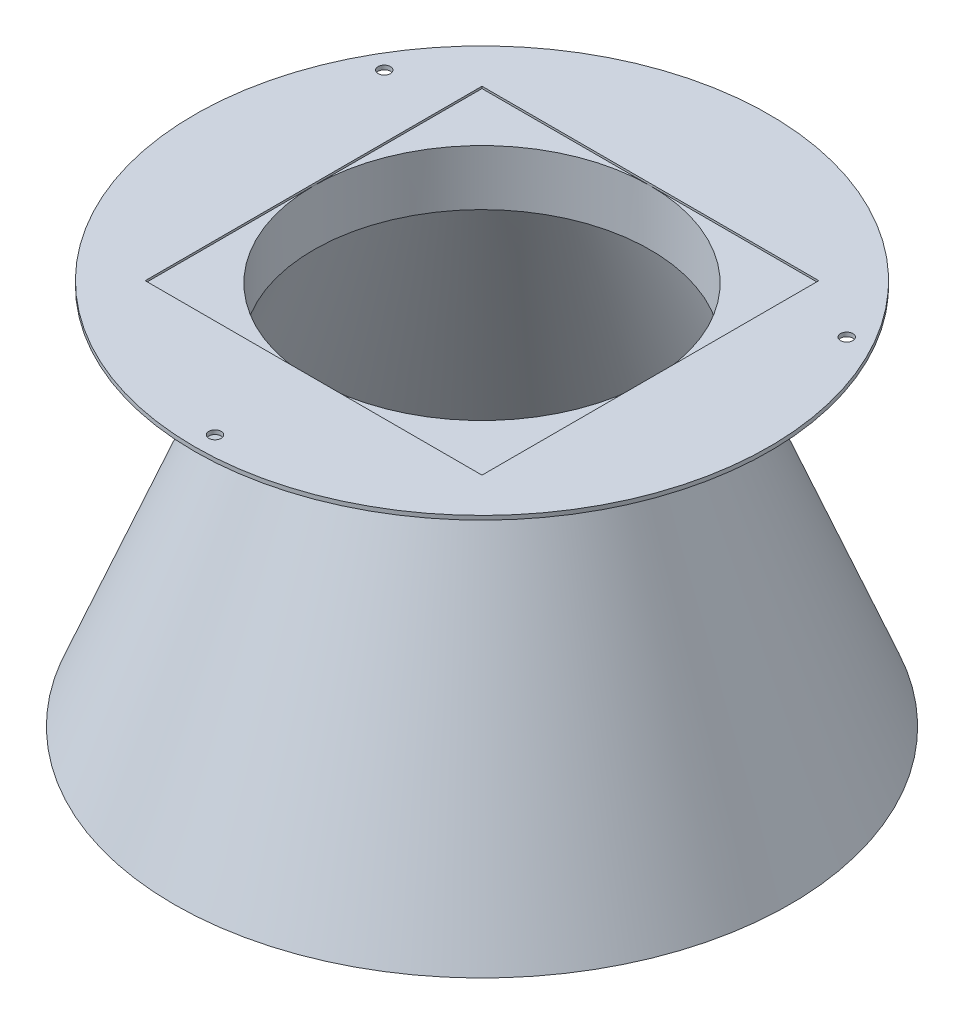
ISO-10303-21;
HEADER;
FILE_DESCRIPTION(('STEP AP214'),'2;1');
FILE_NAME('part.step','',(''),(''),'','','');
FILE_SCHEMA(('AUTOMOTIVE_DESIGN { 1 0 10303 214 1 1 1 1 }'));
ENDSEC;
DATA;
#1=APPLICATION_CONTEXT('core data for automotive mechanical design processes');
#2=APPLICATION_PROTOCOL_DEFINITION('international standard','automotive_design',2000,#1);
#3=PRODUCT_CONTEXT('',#1,'mechanical');
#4=PRODUCT('Part','Part','',(#3));
#5=PRODUCT_RELATED_PRODUCT_CATEGORY('part','',(#4));
#6=PRODUCT_DEFINITION_FORMATION('','',#4);
#7=PRODUCT_DEFINITION_CONTEXT('part definition',#1,'design');
#8=PRODUCT_DEFINITION('design','',#6,#7);
#9=PRODUCT_DEFINITION_SHAPE('','',#8);
#10=(LENGTH_UNIT() NAMED_UNIT(*) SI_UNIT(.MILLI.,.METRE.));
#11=(NAMED_UNIT(*) PLANE_ANGLE_UNIT() SI_UNIT($,.RADIAN.));
#12=(NAMED_UNIT(*) SI_UNIT($,.STERADIAN.) SOLID_ANGLE_UNIT());
#13=UNCERTAINTY_MEASURE_WITH_UNIT(LENGTH_MEASURE(1.E-05),#10,'distance_accuracy_value','');
#14=(GEOMETRIC_REPRESENTATION_CONTEXT(3) GLOBAL_UNCERTAINTY_ASSIGNED_CONTEXT((#13)) GLOBAL_UNIT_ASSIGNED_CONTEXT((#10,
#11,#12)) REPRESENTATION_CONTEXT('',''));
#15=CARTESIAN_POINT('',(0.,0.,0.));
#16=DIRECTION('',(0.,0.,1.));
#17=DIRECTION('',(1.,0.,0.));
#18=AXIS2_PLACEMENT_3D('',#15,#16,#17);
#19=CARTESIAN_POINT('',(-26.9016428172304,46.9761170199418,0.));
#20=DIRECTION('',(0.,1.,0.));
#21=DIRECTION('',(0.,0.,1.));
#22=AXIS2_PLACEMENT_3D('',#19,#20,#21);
#23=CYLINDRICAL_SURFACE('',#22,41.);
#24=CARTESIAN_POINT('',(-26.9016428172304,46.9761170199418,0.));
#25=DIRECTION('',(0.,1.,0.));
#26=DIRECTION('',(0.,0.,1.));
#27=AXIS2_PLACEMENT_3D('',#24,#25,#26);
#28=CIRCLE('',#27,41.);
#29=CARTESIAN_POINT('',(-26.9016428172304,46.9761170199418,41.));
#30=VERTEX_POINT('',#29);
#31=EDGE_CURVE('E143',#30,#30,#28,.T.);
#32=ORIENTED_EDGE('',*,*,#31,.F.);
#33=EDGE_LOOP('',(#32));
#34=FACE_BOUND('',#33,.T.);
#35=CARTESIAN_POINT('',(-26.9016428172304,60.4761170199418,0.));
#36=DIRECTION('',(0.,1.,0.));
#37=DIRECTION('',(0.,0.,1.));
#38=AXIS2_PLACEMENT_3D('',#35,#36,#37);
#39=CIRCLE('',#38,41.);
#40=CARTESIAN_POINT('',(-67.9016428172304,60.4761170199418,0.));
#41=VERTEX_POINT('',#40);
#42=CARTESIAN_POINT('',(-26.9016428172304,60.4761170199418,41.));
#43=VERTEX_POINT('',#42);
#44=EDGE_CURVE('E37',#41,#43,#39,.T.);
#45=ORIENTED_EDGE('',*,*,#44,.T.);
#46=CARTESIAN_POINT('',(14.0983571827696,60.4761170199418,0.));
#47=VERTEX_POINT('',#46);
#48=EDGE_CURVE('E11',#43,#47,#39,.T.);
#49=ORIENTED_EDGE('',*,*,#48,.T.);
#50=CARTESIAN_POINT('',(-26.9016428172304,60.4761170199418,-41.));
#51=VERTEX_POINT('',#50);
#52=EDGE_CURVE('E42',#47,#51,#39,.T.);
#53=ORIENTED_EDGE('',*,*,#52,.T.);
#54=EDGE_CURVE('E248',#51,#41,#39,.T.);
#55=ORIENTED_EDGE('',*,*,#54,.T.);
#56=EDGE_LOOP('',(#45,#49,#53,#55));
#57=FACE_BOUND('',#56,.T.);
#58=ADVANCED_FACE('F33',(#34,#57),#23,.F.);
#59=CARTESIAN_POINT('',(-26.9016428172304,-33.0238829800582,0.));
#60=DIRECTION('',(0.,-1.,0.));
#61=DIRECTION('',(0.,0.,-1.));
#62=AXIS2_PLACEMENT_3D('',#59,#60,#61);
#63=CONICAL_SURFACE('',#62,73.,0.380506377112365);
#64=ORIENTED_EDGE('',*,*,#31,.T.);
#65=EDGE_LOOP('',(#64));
#66=FACE_BOUND('',#65,.T.);
#67=CARTESIAN_POINT('',(-26.9016428172304,-33.0238829800582,0.));
#68=DIRECTION('',(0.,1.,0.));
#69=DIRECTION('',(0.,0.,1.));
#70=AXIS2_PLACEMENT_3D('',#67,#68,#69);
#71=CIRCLE('',#70,73.);
#72=CARTESIAN_POINT('',(-26.9016428172304,-33.0238829800582,73.));
#73=VERTEX_POINT('',#72);
#74=EDGE_CURVE('E161',#73,#73,#71,.T.);
#75=ORIENTED_EDGE('',*,*,#74,.F.);
#76=EDGE_LOOP('',(#75));
#77=FACE_BOUND('',#76,.T.);
#78=ADVANCED_FACE('F35',(#66,#77),#63,.F.);
#79=CARTESIAN_POINT('',(-101.90164281723,-33.0238829800582,0.));
#80=DIRECTION('',(0.,-1.,0.));
#81=DIRECTION('',(0.,0.,-1.));
#82=AXIS2_PLACEMENT_3D('',#79,#80,#81);
#83=PLANE('',#82);
#84=ORIENTED_EDGE('',*,*,#74,.T.);
#85=EDGE_LOOP('',(#84));
#86=FACE_BOUND('',#85,.T.);
#87=CARTESIAN_POINT('',(-26.9016428172304,-33.0238829800582,0.));
#88=DIRECTION('',(0.,1.,0.));
#89=DIRECTION('',(0.,0.,1.));
#90=AXIS2_PLACEMENT_3D('',#87,#88,#89);
#91=CIRCLE('',#90,75.);
#92=CARTESIAN_POINT('',(-26.9016428172304,-33.0238829800582,75.));
#93=VERTEX_POINT('',#92);
#94=EDGE_CURVE('E158',#93,#93,#91,.T.);
#95=ORIENTED_EDGE('',*,*,#94,.F.);
#96=EDGE_LOOP('',(#95));
#97=FACE_BOUND('',#96,.T.);
#98=ADVANCED_FACE('F202',(#86,#97),#83,.T.);
#99=CARTESIAN_POINT('',(-26.9016428172304,46.9761170199418,0.));
#100=DIRECTION('',(0.,-1.,0.));
#101=DIRECTION('',(0.,0.,-1.));
#102=AXIS2_PLACEMENT_3D('',#99,#100,#101);
#103=CONICAL_SURFACE('',#102,43.,0.380506377112365);
#104=ORIENTED_EDGE('',*,*,#94,.T.);
#105=EDGE_LOOP('',(#104));
#106=FACE_BOUND('',#105,.T.);
#107=CARTESIAN_POINT('',(-26.9016428172304,46.9761170199418,0.));
#108=DIRECTION('',(0.,1.,0.));
#109=DIRECTION('',(0.,0.,1.));
#110=AXIS2_PLACEMENT_3D('',#107,#108,#109);
#111=CIRCLE('',#110,43.);
#112=CARTESIAN_POINT('',(-26.9016428172304,46.9761170199418,43.));
#113=VERTEX_POINT('',#112);
#114=EDGE_CURVE('E155',#113,#113,#111,.T.);
#115=ORIENTED_EDGE('',*,*,#114,.F.);
#116=EDGE_LOOP('',(#115));
#117=FACE_BOUND('',#116,.T.);
#118=ADVANCED_FACE('F329',(#106,#117),#103,.T.);
#119=CARTESIAN_POINT('',(-26.9016428172304,59.9761170199418,0.));
#120=DIRECTION('',(0.,1.,0.));
#121=DIRECTION('',(0.,0.,1.));
#122=AXIS2_PLACEMENT_3D('',#119,#120,#121);
#123=CONICAL_SURFACE('',#122,60.,0.917949695694122);
#124=ORIENTED_EDGE('',*,*,#114,.T.);
#125=EDGE_LOOP('',(#124));
#126=FACE_BOUND('',#125,.T.);
#127=CARTESIAN_POINT('',(-26.9016428172304,59.9761170199418,0.));
#128=DIRECTION('',(0.,1.,0.));
#129=DIRECTION('',(0.,0.,1.));
#130=AXIS2_PLACEMENT_3D('',#127,#128,#129);
#131=CIRCLE('',#130,60.);
#132=CARTESIAN_POINT('',(-26.9016428172304,59.9761170199418,60.));
#133=VERTEX_POINT('',#132);
#134=EDGE_CURVE('E152',#133,#133,#131,.T.);
#135=ORIENTED_EDGE('',*,*,#134,.F.);
#136=EDGE_LOOP('',(#135));
#137=FACE_BOUND('',#136,.T.);
#138=ADVANCED_FACE('F193',(#126,#137),#123,.T.);
#139=CARTESIAN_POINT('',(-96.9016428172304,59.9761170199418,0.));
#140=DIRECTION('',(0.,-1.,0.));
#141=DIRECTION('',(0.,0.,-1.));
#142=AXIS2_PLACEMENT_3D('',#139,#140,#141);
#143=PLANE('',#142);
#144=CARTESIAN_POINT('',(-83.1932940632187,59.9761170199418,-32.5000000000002));
#145=DIRECTION('',(0.,-1.,0.));
#146=DIRECTION('',(0.,0.,-1.));
#147=AXIS2_PLACEMENT_3D('',#144,#145,#146);
#148=CIRCLE('',#147,1.50000000000001);
#149=CARTESIAN_POINT('',(-83.1932940632187,59.9761170199418,-34.0000000000003));
#150=VERTEX_POINT('',#149);
#151=EDGE_CURVE('E131',#150,#150,#148,.T.);
#152=ORIENTED_EDGE('',*,*,#151,.F.);
#153=EDGE_LOOP('',(#152));
#154=FACE_BOUND('',#153,.T.);
#155=CARTESIAN_POINT('',(29.3900084287585,59.9761170199418,-32.4999999999995));
#156=DIRECTION('',(0.,-1.,0.));
#157=DIRECTION('',(0.,0.,-1.));
#158=AXIS2_PLACEMENT_3D('',#155,#156,#157);
#159=CIRCLE('',#158,1.5);
#160=CARTESIAN_POINT('',(29.3900084287585,59.9761170199418,-33.9999999999995));
#161=VERTEX_POINT('',#160);
#162=EDGE_CURVE('E135',#161,#161,#159,.T.);
#163=ORIENTED_EDGE('',*,*,#162,.F.);
#164=EDGE_LOOP('',(#163));
#165=FACE_BOUND('',#164,.T.);
#166=CARTESIAN_POINT('',(-26.9016428172304,59.9761170199418,65.));
#167=DIRECTION('',(0.,-1.,0.));
#168=DIRECTION('',(0.,0.,-1.));
#169=AXIS2_PLACEMENT_3D('',#166,#167,#168);
#170=CIRCLE('',#169,1.5);
#171=CARTESIAN_POINT('',(-26.9016428172304,59.9761170199418,63.5));
#172=VERTEX_POINT('',#171);
#173=EDGE_CURVE('E139',#172,#172,#170,.T.);
#174=ORIENTED_EDGE('',*,*,#173,.F.);
#175=EDGE_LOOP('',(#174));
#176=FACE_BOUND('',#175,.T.);
#177=ORIENTED_EDGE('',*,*,#134,.T.);
#178=EDGE_LOOP('',(#177));
#179=FACE_BOUND('',#178,.T.);
#180=CARTESIAN_POINT('',(-26.9016428172304,59.9761170199418,0.));
#181=DIRECTION('',(0.,1.,0.));
#182=DIRECTION('',(0.,0.,1.));
#183=AXIS2_PLACEMENT_3D('',#180,#181,#182);
#184=CIRCLE('',#183,70.);
#185=CARTESIAN_POINT('',(-26.9016428172304,59.9761170199418,70.));
#186=VERTEX_POINT('',#185);
#187=EDGE_CURVE('E149',#186,#186,#184,.T.);
#188=ORIENTED_EDGE('',*,*,#187,.F.);
#189=EDGE_LOOP('',(#188));
#190=FACE_BOUND('',#189,.T.);
#191=ADVANCED_FACE('F187',(#154,#165,#176,#179,#190),#143,.T.);
#192=CARTESIAN_POINT('',(-26.9016428172304,46.9761170199418,0.));
#193=DIRECTION('',(0.,1.,0.));
#194=DIRECTION('',(0.,0.,1.));
#195=AXIS2_PLACEMENT_3D('',#192,#193,#194);
#196=CYLINDRICAL_SURFACE('',#195,70.);
#197=ORIENTED_EDGE('',*,*,#187,.T.);
#198=EDGE_LOOP('',(#197));
#199=FACE_BOUND('',#198,.T.);
#200=CARTESIAN_POINT('',(-26.9016428172304,60.9761170199418,0.));
#201=DIRECTION('',(0.,1.,0.));
#202=DIRECTION('',(0.,0.,1.));
#203=AXIS2_PLACEMENT_3D('',#200,#201,#202);
#204=CIRCLE('',#203,70.);
#205=CARTESIAN_POINT('',(-26.9016428172304,60.9761170199418,70.));
#206=VERTEX_POINT('',#205);
#207=EDGE_CURVE('E146',#206,#206,#204,.T.);
#208=ORIENTED_EDGE('',*,*,#207,.F.);
#209=EDGE_LOOP('',(#208));
#210=FACE_BOUND('',#209,.T.);
#211=ADVANCED_FACE('F177',(#199,#210),#196,.T.);
#212=CARTESIAN_POINT('',(-96.9016428172304,60.9761170199418,0.));
#213=DIRECTION('',(0.,1.,0.));
#214=DIRECTION('',(0.,0.,1.));
#215=AXIS2_PLACEMENT_3D('',#212,#213,#214);
#216=PLANE('',#215);
#217=DIRECTION('',(-1.,0.,0.));
#218=VECTOR('',#217,1.);
#219=CARTESIAN_POINT('',(-96.9016428172304,60.9761170199418,-41.));
#220=LINE('',#219,#218);
#221=CARTESIAN_POINT('',(14.0983571827696,60.9761170199418,-41.));
#222=VERTEX_POINT('',#221);
#223=CARTESIAN_POINT('',(-67.9016428172304,60.9761170199418,-41.));
#224=VERTEX_POINT('',#223);
#225=EDGE_CURVE('E57',#222,#224,#220,.T.);
#226=ORIENTED_EDGE('',*,*,#225,.F.);
#227=DIRECTION('',(0.,0.,-1.));
#228=VECTOR('',#227,1.);
#229=CARTESIAN_POINT('',(14.0983571827696,60.9761170199418,0.));
#230=LINE('',#229,#228);
#231=CARTESIAN_POINT('',(14.0983571827696,60.9761170199418,41.));
#232=VERTEX_POINT('',#231);
#233=EDGE_CURVE('E127',#232,#222,#230,.T.);
#234=ORIENTED_EDGE('',*,*,#233,.F.);
#235=DIRECTION('',(1.,0.,0.));
#236=VECTOR('',#235,1.);
#237=CARTESIAN_POINT('',(-96.9016428172304,60.9761170199418,41.));
#238=LINE('',#237,#236);
#239=CARTESIAN_POINT('',(-67.9016428172304,60.9761170199418,41.));
#240=VERTEX_POINT('',#239);
#241=EDGE_CURVE('E121',#240,#232,#238,.T.);
#242=ORIENTED_EDGE('',*,*,#241,.F.);
#243=DIRECTION('',(0.,0.,1.));
#244=VECTOR('',#243,1.);
#245=CARTESIAN_POINT('',(-67.9016428172304,60.9761170199418,0.));
#246=LINE('',#245,#244);
#247=EDGE_CURVE('E100',#224,#240,#246,.T.);
#248=ORIENTED_EDGE('',*,*,#247,.F.);
#249=EDGE_LOOP('',(#226,#234,#242,#248));
#250=FACE_BOUND('',#249,.T.);
#251=CARTESIAN_POINT('',(-83.1932940632187,60.9761170199418,-32.5000000000002));
#252=DIRECTION('',(0.,1.,0.));
#253=DIRECTION('',(0.,0.,1.));
#254=AXIS2_PLACEMENT_3D('',#251,#252,#253);
#255=CIRCLE('',#254,1.50000000000001);
#256=CARTESIAN_POINT('',(-83.1932940632187,60.9761170199418,-31.0000000000002));
#257=VERTEX_POINT('',#256);
#258=EDGE_CURVE('E134',#257,#257,#255,.T.);
#259=ORIENTED_EDGE('',*,*,#258,.F.);
#260=EDGE_LOOP('',(#259));
#261=FACE_BOUND('',#260,.T.);
#262=CARTESIAN_POINT('',(29.3900084287585,60.9761170199418,-32.4999999999995));
#263=DIRECTION('',(0.,1.,0.));
#264=DIRECTION('',(0.,0.,1.));
#265=AXIS2_PLACEMENT_3D('',#262,#263,#264);
#266=CIRCLE('',#265,1.5);
#267=CARTESIAN_POINT('',(29.3900084287585,60.9761170199418,-30.9999999999995));
#268=VERTEX_POINT('',#267);
#269=EDGE_CURVE('E138',#268,#268,#266,.T.);
#270=ORIENTED_EDGE('',*,*,#269,.F.);
#271=EDGE_LOOP('',(#270));
#272=FACE_BOUND('',#271,.T.);
#273=CARTESIAN_POINT('',(-26.9016428172304,60.9761170199418,65.));
#274=DIRECTION('',(0.,1.,0.));
#275=DIRECTION('',(0.,0.,1.));
#276=AXIS2_PLACEMENT_3D('',#273,#274,#275);
#277=CIRCLE('',#276,1.5);
#278=CARTESIAN_POINT('',(-26.9016428172304,60.9761170199418,66.5));
#279=VERTEX_POINT('',#278);
#280=EDGE_CURVE('E142',#279,#279,#277,.T.);
#281=ORIENTED_EDGE('',*,*,#280,.F.);
#282=EDGE_LOOP('',(#281));
#283=FACE_BOUND('',#282,.T.);
#284=ORIENTED_EDGE('',*,*,#207,.T.);
#285=EDGE_LOOP('',(#284));
#286=FACE_BOUND('',#285,.T.);
#287=ADVANCED_FACE('F173',(#250,#261,#272,#283,#286),#216,.T.);
#288=CARTESIAN_POINT('',(-26.9016428172304,69.9761170199418,65.));
#289=DIRECTION('',(0.,-1.,0.));
#290=DIRECTION('',(0.,0.,-1.));
#291=AXIS2_PLACEMENT_3D('',#288,#289,#290);
#292=CYLINDRICAL_SURFACE('',#291,1.5);
#293=ORIENTED_EDGE('',*,*,#280,.T.);
#294=EDGE_LOOP('',(#293));
#295=FACE_BOUND('',#294,.T.);
#296=ORIENTED_EDGE('',*,*,#173,.T.);
#297=EDGE_LOOP('',(#296));
#298=FACE_BOUND('',#297,.T.);
#299=ADVANCED_FACE('F176',(#295,#298),#292,.F.);
#300=CARTESIAN_POINT('',(29.3900084287585,69.9761170199418,-32.4999999999995));
#301=DIRECTION('',(0.,-1.,0.));
#302=DIRECTION('',(0.,0.,-1.));
#303=AXIS2_PLACEMENT_3D('',#300,#301,#302);
#304=CYLINDRICAL_SURFACE('',#303,1.5);
#305=ORIENTED_EDGE('',*,*,#269,.T.);
#306=EDGE_LOOP('',(#305));
#307=FACE_BOUND('',#306,.T.);
#308=ORIENTED_EDGE('',*,*,#162,.T.);
#309=EDGE_LOOP('',(#308));
#310=FACE_BOUND('',#309,.T.);
#311=ADVANCED_FACE('F209',(#307,#310),#304,.F.);
#312=CARTESIAN_POINT('',(-83.1932940632187,69.9761170199418,-32.5000000000002));
#313=DIRECTION('',(0.,-1.,0.));
#314=DIRECTION('',(0.,0.,-1.));
#315=AXIS2_PLACEMENT_3D('',#312,#313,#314);
#316=CYLINDRICAL_SURFACE('',#315,1.50000000000001);
#317=ORIENTED_EDGE('',*,*,#258,.T.);
#318=EDGE_LOOP('',(#317));
#319=FACE_BOUND('',#318,.T.);
#320=ORIENTED_EDGE('',*,*,#151,.T.);
#321=EDGE_LOOP('',(#320));
#322=FACE_BOUND('',#321,.T.);
#323=ADVANCED_FACE('F170',(#319,#322),#316,.F.);
#324=CARTESIAN_POINT('',(-67.9016428172304,60.4761170199418,41.));
#325=DIRECTION('',(-1.,0.,0.));
#326=DIRECTION('',(0.,0.,1.));
#327=AXIS2_PLACEMENT_3D('',#324,#325,#326);
#328=PLANE('',#327);
#329=ORIENTED_EDGE('',*,*,#247,.T.);
#330=DIRECTION('',(0.,1.,0.));
#331=VECTOR('',#330,1.);
#332=CARTESIAN_POINT('',(-67.9016428172304,60.4761170199418,41.));
#333=LINE('',#332,#331);
#334=CARTESIAN_POINT('',(-67.9016428172304,60.4761170199418,41.));
#335=VERTEX_POINT('',#334);
#336=EDGE_CURVE('E97',#335,#240,#333,.T.);
#337=ORIENTED_EDGE('',*,*,#336,.F.);
#338=DIRECTION('',(0.,0.,1.));
#339=VECTOR('',#338,1.);
#340=CARTESIAN_POINT('',(-67.9016428172304,60.4761170199418,41.));
#341=LINE('',#340,#339);
#342=EDGE_CURVE('E87',#41,#335,#341,.T.);
#343=ORIENTED_EDGE('',*,*,#342,.F.);
#344=CARTESIAN_POINT('',(-67.9016428172304,60.4761170199418,-41.));
#345=VERTEX_POINT('',#344);
#346=EDGE_CURVE('E94',#345,#41,#341,.T.);
#347=ORIENTED_EDGE('',*,*,#346,.F.);
#348=DIRECTION('',(0.,1.,0.));
#349=VECTOR('',#348,1.);
#350=CARTESIAN_POINT('',(-67.9016428172304,60.4761170199418,-41.));
#351=LINE('',#350,#349);
#352=EDGE_CURVE('E119',#345,#224,#351,.T.);
#353=ORIENTED_EDGE('',*,*,#352,.T.);
#354=EDGE_LOOP('',(#329,#337,#343,#347,#353));
#355=FACE_BOUND('',#354,.T.);
#356=ADVANCED_FACE('F98',(#355),#328,.F.);
#357=CARTESIAN_POINT('',(14.0983571827696,60.4761170199418,-41.));
#358=DIRECTION('',(0.,0.,-1.));
#359=DIRECTION('',(-1.,0.,0.));
#360=AXIS2_PLACEMENT_3D('',#357,#358,#359);
#361=PLANE('',#360);
#362=ORIENTED_EDGE('',*,*,#225,.T.);
#363=ORIENTED_EDGE('',*,*,#352,.F.);
#364=DIRECTION('',(-1.,0.,0.));
#365=VECTOR('',#364,1.);
#366=CARTESIAN_POINT('',(14.0983571827696,60.4761170199418,-41.));
#367=LINE('',#366,#365);
#368=EDGE_CURVE('E116',#51,#345,#367,.T.);
#369=ORIENTED_EDGE('',*,*,#368,.F.);
#370=CARTESIAN_POINT('',(14.0983571827696,60.4761170199418,-41.));
#371=VERTEX_POINT('',#370);
#372=EDGE_CURVE('E104',#371,#51,#367,.T.);
#373=ORIENTED_EDGE('',*,*,#372,.F.);
#374=DIRECTION('',(0.,1.,0.));
#375=VECTOR('',#374,1.);
#376=CARTESIAN_POINT('',(14.0983571827696,60.4761170199418,-41.));
#377=LINE('',#376,#375);
#378=EDGE_CURVE('E122',#371,#222,#377,.T.);
#379=ORIENTED_EDGE('',*,*,#378,.T.);
#380=EDGE_LOOP('',(#362,#363,#369,#373,#379));
#381=FACE_BOUND('',#380,.T.);
#382=ADVANCED_FACE('F218',(#381),#361,.F.);
#383=CARTESIAN_POINT('',(14.0983571827696,60.4761170199418,41.));
#384=DIRECTION('',(1.,0.,0.));
#385=DIRECTION('',(0.,0.,-1.));
#386=AXIS2_PLACEMENT_3D('',#383,#384,#385);
#387=PLANE('',#386);
#388=ORIENTED_EDGE('',*,*,#233,.T.);
#389=ORIENTED_EDGE('',*,*,#378,.F.);
#390=DIRECTION('',(0.,0.,-1.));
#391=VECTOR('',#390,1.);
#392=CARTESIAN_POINT('',(14.0983571827696,60.4761170199418,41.));
#393=LINE('',#392,#391);
#394=EDGE_CURVE('E110',#47,#371,#393,.T.);
#395=ORIENTED_EDGE('',*,*,#394,.F.);
#396=CARTESIAN_POINT('',(14.0983571827696,60.4761170199418,41.));
#397=VERTEX_POINT('',#396);
#398=EDGE_CURVE('E112',#397,#47,#393,.T.);
#399=ORIENTED_EDGE('',*,*,#398,.F.);
#400=DIRECTION('',(0.,1.,0.));
#401=VECTOR('',#400,1.);
#402=CARTESIAN_POINT('',(14.0983571827696,60.4761170199418,41.));
#403=LINE('',#402,#401);
#404=EDGE_CURVE('E103',#397,#232,#403,.T.);
#405=ORIENTED_EDGE('',*,*,#404,.T.);
#406=EDGE_LOOP('',(#388,#389,#395,#399,#405));
#407=FACE_BOUND('',#406,.T.);
#408=ADVANCED_FACE('F222',(#407),#387,.F.);
#409=CARTESIAN_POINT('',(14.0983571827696,60.4761170199418,41.));
#410=DIRECTION('',(0.,0.,1.));
#411=DIRECTION('',(1.,0.,0.));
#412=AXIS2_PLACEMENT_3D('',#409,#410,#411);
#413=PLANE('',#412);
#414=ORIENTED_EDGE('',*,*,#241,.T.);
#415=ORIENTED_EDGE('',*,*,#404,.F.);
#416=DIRECTION('',(1.,0.,0.));
#417=VECTOR('',#416,1.);
#418=CARTESIAN_POINT('',(14.0983571827696,60.4761170199418,41.));
#419=LINE('',#418,#417);
#420=EDGE_CURVE('E108',#43,#397,#419,.T.);
#421=ORIENTED_EDGE('',*,*,#420,.F.);
#422=EDGE_CURVE('E49',#335,#43,#419,.T.);
#423=ORIENTED_EDGE('',*,*,#422,.F.);
#424=ORIENTED_EDGE('',*,*,#336,.T.);
#425=EDGE_LOOP('',(#414,#415,#421,#423,#424));
#426=FACE_BOUND('',#425,.T.);
#427=ADVANCED_FACE('F106',(#426),#413,.F.);
#428=CARTESIAN_POINT('',(0.,60.4761170199418,0.));
#429=DIRECTION('',(0.,1.,0.));
#430=DIRECTION('',(0.,0.,1.));
#431=AXIS2_PLACEMENT_3D('',#428,#429,#430);
#432=PLANE('',#431);
#433=ORIENTED_EDGE('',*,*,#420,.T.);
#434=ORIENTED_EDGE('',*,*,#398,.T.);
#435=ORIENTED_EDGE('',*,*,#48,.F.);
#436=EDGE_LOOP('',(#433,#434,#435));
#437=FACE_BOUND('',#436,.T.);
#438=ADVANCED_FACE('F221',(#437),#432,.T.);
#439=ORIENTED_EDGE('',*,*,#394,.T.);
#440=ORIENTED_EDGE('',*,*,#372,.T.);
#441=ORIENTED_EDGE('',*,*,#52,.F.);
#442=EDGE_LOOP('',(#439,#440,#441));
#443=FACE_BOUND('',#442,.T.);
#444=ADVANCED_FACE('F233',(#443),#432,.T.);
#445=ORIENTED_EDGE('',*,*,#368,.T.);
#446=ORIENTED_EDGE('',*,*,#346,.T.);
#447=ORIENTED_EDGE('',*,*,#54,.F.);
#448=EDGE_LOOP('',(#445,#446,#447));
#449=FACE_BOUND('',#448,.T.);
#450=ADVANCED_FACE('F229',(#449),#432,.T.);
#451=ORIENTED_EDGE('',*,*,#342,.T.);
#452=ORIENTED_EDGE('',*,*,#422,.T.);
#453=ORIENTED_EDGE('',*,*,#44,.F.);
#454=EDGE_LOOP('',(#451,#452,#453));
#455=FACE_BOUND('',#454,.T.);
#456=ADVANCED_FACE('F89',(#455),#432,.T.);
#457=CLOSED_SHELL('',(#58,#78,#98,#118,#138,#191,#211,#287,#299,#311,#323,#356,#382,#408,#427,
#438,#444,#450,#456));
#458=MANIFOLD_SOLID_BREP('B2',#457);
#459=ADVANCED_BREP_SHAPE_REPRESENTATION('',(#18,#458),#14);
#460=SHAPE_DEFINITION_REPRESENTATION(#9,#459);
ENDSEC;
END-ISO-10303-21;
